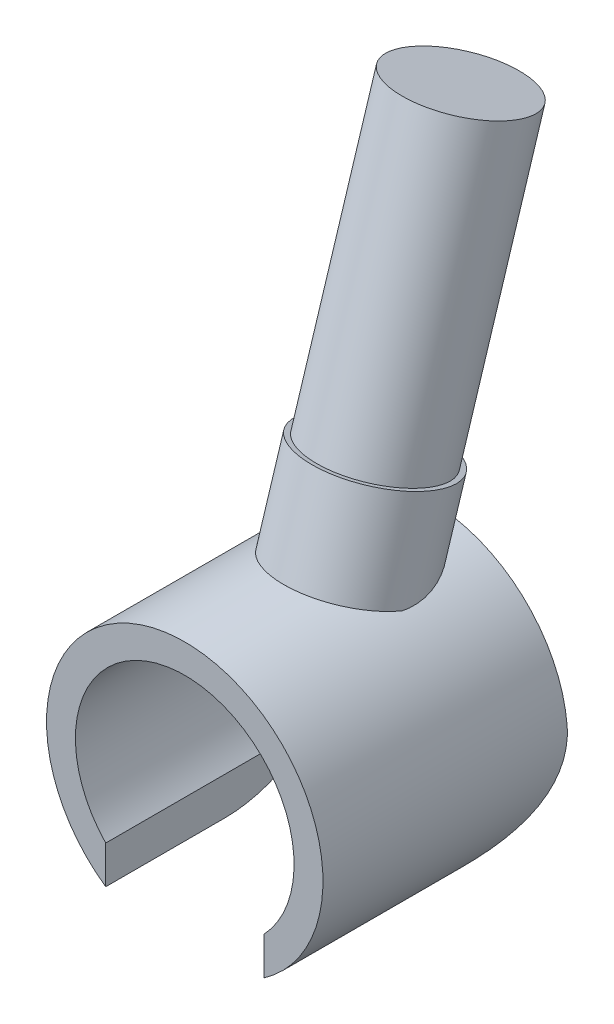
ISO-10303-21;
HEADER;
FILE_DESCRIPTION(('STEP AP214'),'2;1');
FILE_NAME('part.step','',(''),(''),'','','');
FILE_SCHEMA(('AUTOMOTIVE_DESIGN { 1 0 10303 214 1 1 1 1 }'));
ENDSEC;
DATA;
#1=APPLICATION_CONTEXT('core data for automotive mechanical design processes');
#2=APPLICATION_PROTOCOL_DEFINITION('international standard','automotive_design',2000,#1);
#3=PRODUCT_CONTEXT('',#1,'mechanical');
#4=PRODUCT('Part','Part','',(#3));
#5=PRODUCT_RELATED_PRODUCT_CATEGORY('part','',(#4));
#6=PRODUCT_DEFINITION_FORMATION('','',#4);
#7=PRODUCT_DEFINITION_CONTEXT('part definition',#1,'design');
#8=PRODUCT_DEFINITION('design','',#6,#7);
#9=PRODUCT_DEFINITION_SHAPE('','',#8);
#10=(LENGTH_UNIT() NAMED_UNIT(*) SI_UNIT(.MILLI.,.METRE.));
#11=(NAMED_UNIT(*) PLANE_ANGLE_UNIT() SI_UNIT($,.RADIAN.));
#12=(NAMED_UNIT(*) SI_UNIT($,.STERADIAN.) SOLID_ANGLE_UNIT());
#13=UNCERTAINTY_MEASURE_WITH_UNIT(LENGTH_MEASURE(1.E-05),#10,'distance_accuracy_value','');
#14=(GEOMETRIC_REPRESENTATION_CONTEXT(3) GLOBAL_UNCERTAINTY_ASSIGNED_CONTEXT((#13)) GLOBAL_UNIT_ASSIGNED_CONTEXT((#10,
#11,#12)) REPRESENTATION_CONTEXT('',''));
#15=CARTESIAN_POINT('',(0.,0.,0.));
#16=DIRECTION('',(0.,0.,1.));
#17=DIRECTION('',(1.,0.,0.));
#18=AXIS2_PLACEMENT_3D('',#15,#16,#17);
#19=CARTESIAN_POINT('',(0.,0.,2.16));
#20=DIRECTION('',(0.,0.,-1.));
#21=DIRECTION('',(-1.,0.,0.));
#22=AXIS2_PLACEMENT_3D('',#19,#20,#21);
#23=CYLINDRICAL_SURFACE('',#22,2.44);
#24=CARTESIAN_POINT('',(0.,2.44,0.411350822630164));
#25=CARTESIAN_POINT('',(-0.0653005720793101,2.43999803108042,0.411349449987554));
#26=CARTESIAN_POINT('',(-0.130622093755175,2.43735576615697,0.406430054839879));
#27=CARTESIAN_POINT('',(-0.259401431150825,2.42703336891758,0.386848874418601));
#28=CARTESIAN_POINT('',(-0.322858161902783,2.41935036215461,0.372181530384837));
#29=CARTESIAN_POINT('',(-0.446043886956785,2.39969411180188,0.333410248020092));
#30=CARTESIAN_POINT('',(-0.505776502788804,2.38772511502667,0.30931564859478));
#31=CARTESIAN_POINT('',(-0.619983711080264,2.36064975871494,0.252104831495627));
#32=CARTESIAN_POINT('',(-0.674457650161403,2.34554301005308,0.218987494716612));
#33=CARTESIAN_POINT('',(-0.777290595841828,2.31351563449002,0.143816894204556));
#34=CARTESIAN_POINT('',(-0.825571280068302,2.29657598763741,0.101664364527815));
#35=CARTESIAN_POINT('',(-0.913871784853915,2.26289084763905,0.00937185045244081));
#36=CARTESIAN_POINT('',(-0.953893590395186,2.24614530875572,-0.0407662095171709));
#37=CARTESIAN_POINT('',(-1.02352349214199,2.2152695253371,-0.146598044151709));
#38=CARTESIAN_POINT('',(-1.05337231559192,2.20108322693453,-0.202116379447018));
#39=CARTESIAN_POINT('',(-1.1031244932909,2.17657842065135,-0.318208649704171));
#40=CARTESIAN_POINT('',(-1.12303506746608,2.16625710630787,-0.378778877128956));
#41=CARTESIAN_POINT('',(-1.15153833613523,2.15123256306753,-0.498676812178326));
#42=CARTESIAN_POINT('',(-1.16081869501244,2.14619007986342,-0.557800610168284));
#43=CARTESIAN_POINT('',(-1.17068211053481,2.14082566462746,-0.676971017784378));
#44=CARTESIAN_POINT('',(-1.17126271580205,2.14050506310688,-0.737017882737286));
#45=CARTESIAN_POINT('',(-1.16423506373046,2.14433449272221,-0.85772369680256));
#46=CARTESIAN_POINT('',(-1.15645358761399,2.14857909264086,-0.918368786382599));
#47=CARTESIAN_POINT('',(-1.13319910098492,2.1609325459169,-1.03773711921797));
#48=CARTESIAN_POINT('',(-1.11772316374878,2.16904286962173,-1.09645962211783));
#49=CARTESIAN_POINT('',(-1.07671707659821,2.18972342536444,-1.22025764072028));
#50=CARTESIAN_POINT('',(-1.04997446814819,2.20279960693641,-1.28484641918799));
#51=CARTESIAN_POINT('',(-0.987764946383581,2.23138781288698,-1.40917626207865));
#52=CARTESIAN_POINT('',(-0.952285522456569,2.24690331861501,-1.46891021007678));
#53=CARTESIAN_POINT('',(-0.866969844278439,2.28131417880454,-1.59101613056404));
#54=CARTESIAN_POINT('',(-0.815769267648238,2.30036411849533,-1.65240110791273));
#55=CARTESIAN_POINT('',(-0.702746081641513,2.33736282386326,-1.76485214681573));
#56=CARTESIAN_POINT('',(-0.640942336523951,2.35531346963934,-1.81593618969345));
#57=CARTESIAN_POINT('',(-0.526915978088908,2.38292498380965,-1.89180434756867));
#58=CARTESIAN_POINT('',(-0.477123297779669,2.39347936650078,-1.91991790188145));
#59=CARTESIAN_POINT('',(-0.373291333948902,2.4118504840692,-1.96804917977064));
#60=CARTESIAN_POINT('',(-0.319256474665445,2.41967002591027,-1.98807520744345));
#61=CARTESIAN_POINT('',(-0.207765799580774,2.43178827022296,-2.01885737718193));
#62=CARTESIAN_POINT('',(-0.150288409987918,2.43606156837348,-2.02954666151028));
#63=CARTESIAN_POINT('',(-0.0341898752733999,2.44045027622977,-2.04052299584674));
#64=CARTESIAN_POINT('',(0.0244307285664932,2.44056760804509,-2.04081485460229));
#65=CARTESIAN_POINT('',(0.134173875363199,2.43685830965271,-2.03154018580275));
#66=CARTESIAN_POINT('',(0.185408298910467,2.43346668739952,-2.02306102807827));
#67=CARTESIAN_POINT('',(0.285698310027522,2.42374018115414,-1.99844586173391));
#68=CARTESIAN_POINT('',(0.334753436338657,2.41740467729643,-1.982308240528));
#69=CARTESIAN_POINT('',(0.431291719158435,2.40209506527847,-1.94259872325348));
#70=CARTESIAN_POINT('',(0.478663699301287,2.39303811003252,-1.91879140116926));
#71=CARTESIAN_POINT('',(0.569332063833355,2.37310339892996,-1.86502438549683));
#72=CARTESIAN_POINT('',(0.612626866068338,2.36222494074863,-1.83506231778234));
#73=CARTESIAN_POINT('',(0.702251454587681,2.33730215537085,-1.76406772199364));
#74=CARTESIAN_POINT('',(0.747709300454707,2.32304137214549,-1.72201297820579));
#75=CARTESIAN_POINT('',(0.83222390601898,2.2941234583253,-1.63200018463442));
#76=CARTESIAN_POINT('',(0.871274046668774,2.27946593588201,-1.58403611903223));
#77=CARTESIAN_POINT('',(0.950340221066301,2.24780561607845,-1.4725544863801));
#78=CARTESIAN_POINT('',(0.988814902197354,2.230962169129,-1.40789254085581));
#79=CARTESIAN_POINT('',(1.0555381706857,2.20017995575262,-1.27282862675951));
#80=CARTESIAN_POINT('',(1.08378626438138,2.18624132956206,-1.20242638129056));
#81=CARTESIAN_POINT('',(1.12658614300239,2.16446680277572,-1.06526659678993));
#82=CARTESIAN_POINT('',(1.14229924796789,2.15612966927259,-0.998954535665516));
#83=CARTESIAN_POINT('',(1.16382021162268,2.14459271562602,-0.8643021210946));
#84=CARTESIAN_POINT('',(1.16963753590325,2.14138798636622,-0.795963769600038));
#85=CARTESIAN_POINT('',(1.17033167439234,2.14101136213739,-0.65863777165604));
#86=CARTESIAN_POINT('',(1.16512613794288,2.14388487693287,-0.589649098491598));
#87=CARTESIAN_POINT('',(1.14292194545841,2.15580279166821,-0.454142243169775));
#88=CARTESIAN_POINT('',(1.12593000010488,2.16484368011857,-0.387622677900154));
#89=CARTESIAN_POINT('',(1.08319394272923,2.1864992180922,-0.267692927743385));
#90=CARTESIAN_POINT('',(1.05881111491558,2.19852509185328,-0.213683917418265));
#91=CARTESIAN_POINT('',(1.00175894778489,2.22509910319673,-0.110923290047883));
#92=CARTESIAN_POINT('',(0.969088396354225,2.23964760962591,-0.0621724435183424));
#93=CARTESIAN_POINT('',(0.896089244840698,2.2698437565163,0.0293858963028985));
#94=CARTESIAN_POINT('',(0.855709139709221,2.28549831575554,0.0721498574375224));
#95=CARTESIAN_POINT('',(0.768456773021097,2.31629319271887,0.150673756458614));
#96=CARTESIAN_POINT('',(0.721582317750198,2.33143333451789,0.1864313177715));
#97=CARTESIAN_POINT('',(0.619017251716324,2.36081612525713,0.252654974649521));
#98=CARTESIAN_POINT('',(0.562941366840129,2.37492460104106,0.282585156116928));
#99=CARTESIAN_POINT('',(0.446121166554609,2.3996112726627,0.333372957970391));
#100=CARTESIAN_POINT('',(0.385379026658519,2.41019110149251,0.354234776385552));
#101=CARTESIAN_POINT('',(0.27071757978636,2.42551296667486,0.383975491317249));
#102=CARTESIAN_POINT('',(0.217237535005981,2.4309134413503,0.394227288269128));
#103=CARTESIAN_POINT('',(0.109176511760547,2.43815770929765,0.407915390170712));
#104=CARTESIAN_POINT('',(0.0545955778280971,2.4400016461464,0.411351970249765));
#105=CARTESIAN_POINT('',(0.,2.44,0.411350822630164));
#106=B_SPLINE_CURVE_WITH_KNOTS('',3,(#24,#25,#26,#27,#28,#29,#30,#31,#32,#33,#34,#35,#36,#37,
#38,#39,#40,#41,#42,#43,#44,#45,#46,#47,#48,#49,#50,#51,#52,#53,#54,#55,#56,#57,#58,#59,#60,#61,
#62,#63,#64,#65,#66,#67,#68,#69,#70,#71,#72,#73,#74,#75,#76,#77,#78,#79,#80,#81,#82,#83,#84,#85,
#86,#87,#88,#89,#90,#91,#92,#93,#94,#95,#96,#97,#98,#99,#100,#101,#102,#103,#104,#105),
.UNSPECIFIED.,.T.,.F.,(4,2,2,2,2,2,2,2,2,2,2,2,2,2,2,2,2,2,2,2,2,2,2,2,2,2,2,2,2,2,2,2,2,2,2,2,
2,2,2,2,4),(0.,0.195703006941414,0.391517709233812,0.587138921091933,0.782784407230017,
0.980700949073429,1.17856986707394,1.37136470527047,1.56401927753215,1.74334639043292,
1.92272403238073,2.10589037075295,2.28912643302302,2.50167913395974,2.71453798617089,
2.95985926481142,3.20474853086091,3.37851962417741,3.55211183668365,3.72693713598632,
3.90168157857876,4.05708853713275,4.2125282331095,4.37328517042449,4.53410423482057,
4.72406831648601,4.91422740896027,5.14459094329916,5.37496559634942,5.5801057591812,
5.78504958913707,5.99152993300068,6.19789281210453,6.37843233112948,6.55899827003933,
6.7408156254192,6.9226945469586,7.11713309383293,7.31148153290818,7.47510873807879,
7.63872933750762),.UNSPECIFIED.);
#107=CARTESIAN_POINT('',(-1.15377398770942,2.14997804297744,-0.520375199168794));
#108=VERTEX_POINT('',#107);
#109=CARTESIAN_POINT('',(1.15377398770942,2.14997804297744,-0.520375199168794));
#110=VERTEX_POINT('',#109);
#111=EDGE_CURVE('E103',#108,#110,#106,.T.);
#112=ORIENTED_EDGE('',*,*,#111,.T.);
#113=CARTESIAN_POINT('',(0.,0.,-7.42740565128952));
#114=DIRECTION('',(0.,-0.954812686667349,0.297208232354151));
#115=DIRECTION('',(0.,-0.297208232354151,-0.954812686667349));
#116=AXIS2_PLACEMENT_3D('',#113,#114,#115);
#117=ELLIPSE('',#116,8.20973221593846,2.44);
#118=CARTESIAN_POINT('',(0.,2.44,0.411350822630163));
#119=VERTEX_POINT('',#118);
#120=EDGE_CURVE('E102',#110,#119,#117,.T.);
#121=ORIENTED_EDGE('',*,*,#120,.T.);
#122=EDGE_CURVE('E96',#119,#108,#117,.T.);
#123=ORIENTED_EDGE('',*,*,#122,.T.);
#124=EDGE_LOOP('',(#112,#121,#123));
#125=FACE_BOUND('',#124,.T.);
#126=CARTESIAN_POINT('',(0.,0.,-2.16));
#127=DIRECTION('',(0.,0.,1.));
#128=DIRECTION('',(1.,0.,0.));
#129=AXIS2_PLACEMENT_3D('',#126,#127,#128);
#130=CIRCLE('',#129,2.44);
#131=CARTESIAN_POINT('',(2.430232349588,0.218107145724329,-2.16));
#132=VERTEX_POINT('',#131);
#133=CARTESIAN_POINT('',(-2.43023234958799,0.218107145724329,-2.16));
#134=VERTEX_POINT('',#133);
#135=EDGE_CURVE('E163',#132,#134,#130,.T.);
#136=ORIENTED_EDGE('',*,*,#135,.T.);
#137=CARTESIAN_POINT('',(-2.43023234958799,0.218107145724329,-2.16));
#138=CARTESIAN_POINT('',(-2.43474060814688,0.168006973104005,-2.16001168935983));
#139=CARTESIAN_POINT('',(-2.4376758990569,0.117770171176608,-2.1583043473815));
#140=CARTESIAN_POINT('',(-2.44044982061713,0.0174684321543092,-2.15148274119778));
#141=CARTESIAN_POINT('',(-2.44029007287496,-0.0325965811948344,-2.14637026242797));
#142=CARTESIAN_POINT('',(-2.43694014535419,-0.131797724346114,-2.13281936887495));
#143=CARTESIAN_POINT('',(-2.43377220909971,-0.180937974329905,-2.12440563242008));
#144=CARTESIAN_POINT('',(-2.42457354957555,-0.278274928237631,-2.10436547455013));
#145=CARTESIAN_POINT('',(-2.41854261986041,-0.326471563858176,-2.09273882148248));
#146=CARTESIAN_POINT('',(-2.39642945385073,-0.468959479497071,-2.05329392326361));
#147=CARTESIAN_POINT('',(-2.37631639181392,-0.561413034429518,-2.02087377277521));
#148=CARTESIAN_POINT('',(-2.3271424912142,-0.739307803663008,-1.94528047287218));
#149=CARTESIAN_POINT('',(-2.2980651890097,-0.824735746039992,-1.90208756642188));
#150=CARTESIAN_POINT('',(-2.22208906031606,-1.01468152923659,-1.79053536120585));
#151=CARTESIAN_POINT('',(-2.1724829619143,-1.11601335843517,-1.71859205008861));
#152=CARTESIAN_POINT('',(-2.06564631642221,-1.30321386379243,-1.56141588668533));
#153=CARTESIAN_POINT('',(-2.00840177927345,-1.3890534700706,-1.47615859940118));
#154=CARTESIAN_POINT('',(-1.8899038674512,-1.54652412301911,-1.29254783208157));
#155=CARTESIAN_POINT('',(-1.82859610142771,-1.61786458404172,-1.19398219732798));
#156=CARTESIAN_POINT('',(-1.70851989675696,-1.74416017460002,-0.985361210738096));
#157=CARTESIAN_POINT('',(-1.64975004265832,-1.79912454107026,-0.875312383476714));
#158=CARTESIAN_POINT('',(-1.5612664010109,-1.87569756173117,-0.682420740142048));
#159=CARTESIAN_POINT('',(-1.52845436939761,-1.90229801224119,-0.602992652485694));
#160=CARTESIAN_POINT('',(-1.47144099361139,-1.94673145245156,-0.43902559324608));
#161=CARTESIAN_POINT('',(-1.44719584391018,-1.96460922864679,-0.354515286553389));
#162=CARTESIAN_POINT('',(-1.41829905016411,-1.98550395450505,-0.214591813272451));
#163=CARTESIAN_POINT('',(-1.40969894116898,-1.9915908726845,-0.160454200423307));
#164=CARTESIAN_POINT('',(-1.39798705475527,-1.99981224665755,-0.050913632403747));
#165=CARTESIAN_POINT('',(-1.39491468901932,-2.0019183252101,0.00449557859322755));
#166=CARTESIAN_POINT('',(-1.395,-2.00189285427567,0.0600000000000026));
#167=B_SPLINE_CURVE_WITH_KNOTS('',3,(#137,#138,#139,#140,#141,#142,#143,#144,#145,#146,#147,
#148,#149,#150,#151,#152,#153,#154,#155,#156,#157,#158,#159,#160,#161,#162,#163,#164,#165,#166),
.UNSPECIFIED.,.F.,.F.,(4,2,2,2,2,2,2,2,2,2,2,2,2,2,4),(0.,0.150846331968014,0.301613631984807,
0.451274720267462,0.600946601990361,0.899499998603086,1.19860501553044,1.59786296890622,
1.99786247960152,2.40522396872608,2.8123552487426,3.0815494028285,3.34934644287952,
3.51440445371051,3.68063469994443),.UNSPECIFIED.);
#168=CARTESIAN_POINT('',(-1.395,-2.00189285427567,0.0600000000000019));
#169=VERTEX_POINT('',#168);
#170=EDGE_CURVE('E157',#134,#169,#167,.T.);
#171=ORIENTED_EDGE('',*,*,#170,.T.);
#172=DIRECTION('',(0.,0.,-1.));
#173=VECTOR('',#172,1.);
#174=CARTESIAN_POINT('',(-1.395,-2.00189285427567,2.16));
#175=LINE('',#174,#173);
#176=CARTESIAN_POINT('',(-1.395,-2.00189285427567,2.16));
#177=VERTEX_POINT('',#176);
#178=EDGE_CURVE('E186',#177,#169,#175,.T.);
#179=ORIENTED_EDGE('',*,*,#178,.F.);
#180=CARTESIAN_POINT('',(0.,0.,2.16));
#181=DIRECTION('',(0.,0.,1.));
#182=DIRECTION('',(1.,0.,0.));
#183=AXIS2_PLACEMENT_3D('',#180,#181,#182);
#184=CIRCLE('',#183,2.44);
#185=CARTESIAN_POINT('',(1.395,-2.00189285427567,2.16));
#186=VERTEX_POINT('',#185);
#187=EDGE_CURVE('E164',#186,#177,#184,.T.);
#188=ORIENTED_EDGE('',*,*,#187,.F.);
#189=DIRECTION('',(0.,0.,-1.));
#190=VECTOR('',#189,1.);
#191=CARTESIAN_POINT('',(1.395,-2.00189285427567,2.16));
#192=LINE('',#191,#190);
#193=CARTESIAN_POINT('',(1.395,-2.00189285427567,0.0600000000000019));
#194=VERTEX_POINT('',#193);
#195=EDGE_CURVE('E174',#186,#194,#192,.T.);
#196=ORIENTED_EDGE('',*,*,#195,.T.);
#197=CARTESIAN_POINT('',(1.395,-2.00189285427567,0.0600000000000023));
#198=CARTESIAN_POINT('',(1.39497549417186,-2.00190004682214,0.0190355748298361));
#199=CARTESIAN_POINT('',(1.3966286569488,-2.00075856017163,-0.0219004856777222));
#200=CARTESIAN_POINT('',(1.40307178395955,-1.9962499970007,-0.103324324666599));
#201=CARTESIAN_POINT('',(1.40785566693987,-1.99288723506834,-0.143812817793326));
#202=CARTESIAN_POINT('',(1.4264029958197,-1.9796983463629,-0.263076645845645));
#203=CARTESIAN_POINT('',(1.44437530386783,-1.9667668108115,-0.340873583725885));
#204=CARTESIAN_POINT('',(1.49736001707902,-1.92690662521998,-0.522307061088923));
#205=CARTESIAN_POINT('',(1.53630355064597,-1.89646085075228,-0.623955837566314));
#206=CARTESIAN_POINT('',(1.6228510700733,-1.82296684301684,-0.819450953192354));
#207=CARTESIAN_POINT('',(1.67052415633827,-1.77981625547563,-0.913225646178747));
#208=CARTESIAN_POINT('',(1.75315039184214,-1.69773154487245,-1.0637167755138));
#209=CARTESIAN_POINT('',(1.78725378542758,-1.66191720502314,-1.12263961007733));
#210=CARTESIAN_POINT('',(1.85575130772401,-1.58506815034893,-1.23680394987571));
#211=CARTESIAN_POINT('',(1.89014553524551,-1.54403158880396,-1.29204414224594));
#212=CARTESIAN_POINT('',(1.99203481038013,-1.41334265560727,-1.45184299170412));
#213=CARTESIAN_POINT('',(2.05849664197669,-1.31586757883351,-1.55092604023674));
#214=CARTESIAN_POINT('',(2.16658026914772,-1.12625881572758,-1.70988630064897));
#215=CARTESIAN_POINT('',(2.21034051749566,-1.03842799456176,-1.77347168819425));
#216=CARTESIAN_POINT('',(2.2888664736532,-0.851422943099089,-1.88846176692822));
#217=CARTESIAN_POINT('',(2.32364287417548,-0.752262402343806,-1.93988093235025));
#218=CARTESIAN_POINT('',(2.37640148573411,-0.560852946506084,-2.02102148300261));
#219=CARTESIAN_POINT('',(2.3961748234636,-0.47001210116017,-2.05289291788829));
#220=CARTESIAN_POINT('',(2.42531006662676,-0.283435705925214,-2.10475880127211));
#221=CARTESIAN_POINT('',(2.4346893623598,-0.187708612862024,-2.12477306184283));
#222=CARTESIAN_POINT('',(2.44021747583738,-0.0397433074760839,-2.14558422779519));
#223=CARTESIAN_POINT('',(2.44051604297717,0.0117535756679163,-2.15099243216923));
#224=CARTESIAN_POINT('',(2.43783986354329,0.114909952459421,-2.15820369403941));
#225=CARTESIAN_POINT('',(2.43486537271731,0.166569433087527,-2.16000703317872));
#226=CARTESIAN_POINT('',(2.43023234958799,0.218107145724329,-2.16));
#227=B_SPLINE_CURVE_WITH_KNOTS('',3,(#197,#198,#199,#200,#201,#202,#203,#204,#205,#206,#207,
#208,#209,#210,#211,#212,#213,#214,#215,#216,#217,#218,#219,#220,#221,#222,#223,#224,#225,#226),
.UNSPECIFIED.,.F.,.F.,(4,2,2,2,2,2,2,2,2,2,2,2,2,2,4),(0.,0.122794676737796,0.245351536657706,
0.486852474351929,0.824125595645047,1.16419393742833,1.39471038167206,1.6253085705271,
2.08481172056646,2.43436467314526,2.78349964542083,3.07712016359925,3.37024867932407,
3.52538654727439,3.68051229404198),.UNSPECIFIED.);
#228=EDGE_CURVE('E125',#194,#132,#227,.T.);
#229=ORIENTED_EDGE('',*,*,#228,.T.);
#230=EDGE_LOOP('',(#136,#171,#179,#188,#196,#229));
#231=FACE_BOUND('',#230,.T.);
#232=ADVANCED_FACE('F34',(#125,#231),#23,.T.);
#233=CARTESIAN_POINT('',(-1.395,-1.33374472819952,2.16));
#234=DIRECTION('',(-1.,0.,0.));
#235=DIRECTION('',(0.,0.,1.));
#236=AXIS2_PLACEMENT_3D('',#233,#234,#235);
#237=PLANE('',#236);
#238=ORIENTED_EDGE('',*,*,#178,.T.);
#239=CARTESIAN_POINT('',(-1.395,0.218107145724329,0.0600000000000019));
#240=DIRECTION('',(-1.,0.,0.));
#241=DIRECTION('',(0.,0.,1.));
#242=AXIS2_PLACEMENT_3D('',#239,#240,#241);
#243=CIRCLE('',#242,2.22);
#244=CARTESIAN_POINT('',(-1.395,-1.33374472819952,-1.52749984610993));
#245=VERTEX_POINT('',#244);
#246=EDGE_CURVE('E155',#169,#245,#243,.F.);
#247=ORIENTED_EDGE('',*,*,#246,.T.);
#248=DIRECTION('',(0.,0.,-1.));
#249=VECTOR('',#248,1.);
#250=CARTESIAN_POINT('',(-1.395,-1.33374472819952,2.16));
#251=LINE('',#250,#249);
#252=CARTESIAN_POINT('',(-1.395,-1.33374472819952,2.16));
#253=VERTEX_POINT('',#252);
#254=EDGE_CURVE('E184',#253,#245,#251,.T.);
#255=ORIENTED_EDGE('',*,*,#254,.F.);
#256=DIRECTION('',(0.,1.,0.));
#257=VECTOR('',#256,1.);
#258=CARTESIAN_POINT('',(-1.395,-1.33374472819952,2.16));
#259=LINE('',#258,#257);
#260=EDGE_CURVE('E167',#177,#253,#259,.T.);
#261=ORIENTED_EDGE('',*,*,#260,.F.);
#262=EDGE_LOOP('',(#238,#247,#255,#261));
#263=FACE_BOUND('',#262,.T.);
#264=ADVANCED_FACE('F204',(#263),#237,.F.);
#265=CARTESIAN_POINT('',(0.,0.,2.16));
#266=DIRECTION('',(0.,0.,-1.));
#267=DIRECTION('',(-1.,0.,0.));
#268=AXIS2_PLACEMENT_3D('',#265,#266,#267);
#269=CYLINDRICAL_SURFACE('',#268,1.93);
#270=ORIENTED_EDGE('',*,*,#254,.T.);
#271=CARTESIAN_POINT('',(-1.395,-1.33374472819952,-1.52749984610993));
#272=CARTESIAN_POINT('',(-1.4613650591104,-1.26433642421857,-1.59541284265482));
#273=CARTESIAN_POINT('',(-1.52420782443013,-1.18821024003292,-1.66084559551919));
#274=CARTESIAN_POINT('',(-1.640340561821,-1.02204651703401,-1.78423382737669));
#275=CARTESIAN_POINT('',(-1.69352250187591,-0.931870397557288,-1.8421029302637));
#276=CARTESIAN_POINT('',(-1.77666601437337,-0.758659479664663,-1.93547007046637));
#277=CARTESIAN_POINT('',(-1.80915593467325,-0.678023834503858,-1.97311856776486));
#278=CARTESIAN_POINT('',(-1.86342994800844,-0.510131718898834,-2.03907496546273));
#279=CARTESIAN_POINT('',(-1.88528199643524,-0.422921497000988,-2.06744176548355));
#280=CARTESIAN_POINT('',(-1.90875490372367,-0.289105462252128,-2.10176639959498));
#281=CARTESIAN_POINT('',(-1.91501728095762,-0.244296715664214,-2.11179840442425));
#282=CARTESIAN_POINT('',(-1.92439766783169,-0.153814891424227,-2.12910749867783));
#283=CARTESIAN_POINT('',(-1.92751593387305,-0.108141884561813,-2.13638481271605));
#284=CARTESIAN_POINT('',(-1.93049634126748,-0.0157192653420156,-2.14814873751903));
#285=CARTESIAN_POINT('',(-1.93031497838352,0.0310366009128516,-2.15259726081316));
#286=CARTESIAN_POINT('',(-1.92654495623045,0.124627980549224,-2.15853034740784));
#287=CARTESIAN_POINT('',(-1.92295414871276,0.171463525561495,-2.16001304014549));
#288=CARTESIAN_POINT('',(-1.91763637663244,0.218107145724329,-2.16));
#289=B_SPLINE_CURVE_WITH_KNOTS('',3,(#271,#272,#273,#274,#275,#276,#277,#278,#279,#280,#281,
#282,#283,#284,#285,#286,#287,#288),.UNSPECIFIED.,.F.,.F.,(4,2,2,2,2,2,2,2,4),(0.,
0.353464690607776,0.710666733775624,0.99376903384324,1.27503832028141,1.41390310542213,
1.55275656526901,1.69344206161801,1.83421626101107),.UNSPECIFIED.);
#290=CARTESIAN_POINT('',(-1.91763637663244,0.218107145724329,-2.16));
#291=VERTEX_POINT('',#290);
#292=EDGE_CURVE('E149',#245,#291,#289,.T.);
#293=ORIENTED_EDGE('',*,*,#292,.T.);
#294=CARTESIAN_POINT('',(0.,0.,-2.16));
#295=DIRECTION('',(0.,0.,-1.));
#296=DIRECTION('',(1.,0.,0.));
#297=AXIS2_PLACEMENT_3D('',#294,#295,#296);
#298=CIRCLE('',#297,1.93);
#299=CARTESIAN_POINT('',(1.91763637663244,0.218107145724329,-2.16));
#300=VERTEX_POINT('',#299);
#301=EDGE_CURVE('E168',#291,#300,#298,.T.);
#302=ORIENTED_EDGE('',*,*,#301,.T.);
#303=CARTESIAN_POINT('',(1.91763637663244,0.218107145724329,-2.16));
#304=CARTESIAN_POINT('',(1.9226721247151,0.173921329664467,-2.16001047697693));
#305=CARTESIAN_POINT('',(1.92616046455742,0.129562919534623,-2.15868109277474));
#306=CARTESIAN_POINT('',(1.93007409882216,0.0408923616220409,-2.15335818514194));
#307=CARTESIAN_POINT('',(1.93050090339903,-0.0034197981875244,-2.14936597625733));
#308=CARTESIAN_POINT('',(1.92834107636796,-0.0911254582141884,-2.13879628584775));
#309=CARTESIAN_POINT('',(1.92579026432846,-0.134523614522695,-2.13225015235817));
#310=CARTESIAN_POINT('',(1.91783974465311,-0.22059376673638,-2.11666209031369));
#311=CARTESIAN_POINT('',(1.91243988541359,-0.263265723874259,-2.10762002895754));
#312=CARTESIAN_POINT('',(1.8921805373519,-0.38961352641322,-2.07694932926334));
#313=CARTESIAN_POINT('',(1.87325516244209,-0.471826598508137,-2.05175080265074));
#314=CARTESIAN_POINT('',(1.82590936910418,-0.630798639480564,-1.99305094721525));
#315=CARTESIAN_POINT('',(1.79743036630446,-0.707520323030753,-1.95949872777724));
#316=CARTESIAN_POINT('',(1.71714167972385,-0.888982483069175,-1.86805271977348));
#317=CARTESIAN_POINT('',(1.66067782844072,-0.989693579097232,-1.8061716107234));
#318=CARTESIAN_POINT('',(1.5669529542964,-1.12811859799147,-1.7061563243066));
#319=CARTESIAN_POINT('',(1.53435151719598,-1.17200588105377,-1.67176745554311));
#320=CARTESIAN_POINT('',(1.4665472542806,-1.25579285012763,-1.60102335932303));
#321=CARTESIAN_POINT('',(1.43135066747926,-1.29570159006335,-1.56467290078456));
#322=CARTESIAN_POINT('',(1.395,-1.33374472819952,-1.52749984610993));
#323=B_SPLINE_CURVE_WITH_KNOTS('',3,(#303,#304,#305,#306,#307,#308,#309,#310,#311,#312,#313,
#314,#315,#316,#317,#318,#319,#320,#321,#322),.UNSPECIFIED.,.F.,.F.,(4,2,2,2,2,2,2,2,2,4),(0.,
0.133362580494559,0.266659373096977,0.398369040969633,0.530085718092299,0.792906478518415,
1.05736929023088,1.4476166711137,1.6412301938488,1.83439254166487),.UNSPECIFIED.);
#324=CARTESIAN_POINT('',(1.395,-1.33374472819952,-1.52749984610993));
#325=VERTEX_POINT('',#324);
#326=EDGE_CURVE('E57',#300,#325,#323,.T.);
#327=ORIENTED_EDGE('',*,*,#326,.T.);
#328=DIRECTION('',(0.,0.,-1.));
#329=VECTOR('',#328,1.);
#330=CARTESIAN_POINT('',(1.395,-1.33374472819952,2.16));
#331=LINE('',#330,#329);
#332=CARTESIAN_POINT('',(1.395,-1.33374472819952,2.16));
#333=VERTEX_POINT('',#332);
#334=EDGE_CURVE('E181',#333,#325,#331,.T.);
#335=ORIENTED_EDGE('',*,*,#334,.F.);
#336=CARTESIAN_POINT('',(0.,0.,2.16));
#337=DIRECTION('',(0.,0.,-1.));
#338=DIRECTION('',(1.,0.,0.));
#339=AXIS2_PLACEMENT_3D('',#336,#337,#338);
#340=CIRCLE('',#339,1.93);
#341=EDGE_CURVE('E170',#253,#333,#340,.T.);
#342=ORIENTED_EDGE('',*,*,#341,.F.);
#343=EDGE_LOOP('',(#270,#293,#302,#327,#335,#342));
#344=FACE_BOUND('',#343,.T.);
#345=ADVANCED_FACE('F130',(#344),#269,.F.);
#346=CARTESIAN_POINT('',(1.395,-1.33374472819952,2.16));
#347=DIRECTION('',(1.,0.,0.));
#348=DIRECTION('',(0.,0.,-1.));
#349=AXIS2_PLACEMENT_3D('',#346,#347,#348);
#350=PLANE('',#349);
#351=ORIENTED_EDGE('',*,*,#334,.T.);
#352=CARTESIAN_POINT('',(1.395,0.218107145724329,0.0600000000000019));
#353=DIRECTION('',(1.,0.,0.));
#354=DIRECTION('',(0.,0.,-1.));
#355=AXIS2_PLACEMENT_3D('',#352,#353,#354);
#356=CIRCLE('',#355,2.22);
#357=EDGE_CURVE('E111',#325,#194,#356,.F.);
#358=ORIENTED_EDGE('',*,*,#357,.T.);
#359=ORIENTED_EDGE('',*,*,#195,.F.);
#360=DIRECTION('',(0.,-1.,0.));
#361=VECTOR('',#360,1.);
#362=CARTESIAN_POINT('',(1.395,-1.33374472819952,2.16));
#363=LINE('',#362,#361);
#364=EDGE_CURVE('E172',#333,#186,#363,.T.);
#365=ORIENTED_EDGE('',*,*,#364,.F.);
#366=EDGE_LOOP('',(#351,#358,#359,#365));
#367=FACE_BOUND('',#366,.T.);
#368=ADVANCED_FACE('F198',(#367),#350,.F.);
#369=CARTESIAN_POINT('',(0.,0.,2.16));
#370=DIRECTION('',(0.,0.,1.));
#371=DIRECTION('',(1.,0.,0.));
#372=AXIS2_PLACEMENT_3D('',#369,#370,#371);
#373=PLANE('',#372);
#374=ORIENTED_EDGE('',*,*,#187,.T.);
#375=ORIENTED_EDGE('',*,*,#260,.T.);
#376=ORIENTED_EDGE('',*,*,#341,.T.);
#377=ORIENTED_EDGE('',*,*,#364,.T.);
#378=EDGE_LOOP('',(#374,#375,#376,#377));
#379=FACE_BOUND('',#378,.T.);
#380=ADVANCED_FACE('F143',(#379),#373,.T.);
#381=CARTESIAN_POINT('',(0.,0.,-2.16));
#382=DIRECTION('',(0.,0.,1.));
#383=DIRECTION('',(1.,0.,0.));
#384=AXIS2_PLACEMENT_3D('',#381,#382,#383);
#385=PLANE('',#384);
#386=ORIENTED_EDGE('',*,*,#135,.F.);
#387=DIRECTION('',(1.,0.,0.));
#388=VECTOR('',#387,1.);
#389=CARTESIAN_POINT('',(-2.5,0.218107145724329,-2.16));
#390=LINE('',#389,#388);
#391=EDGE_CURVE('E11',#132,#300,#390,.F.);
#392=ORIENTED_EDGE('',*,*,#391,.T.);
#393=ORIENTED_EDGE('',*,*,#301,.F.);
#394=EDGE_CURVE('E38',#291,#134,#390,.F.);
#395=ORIENTED_EDGE('',*,*,#394,.T.);
#396=EDGE_LOOP('',(#386,#392,#393,#395));
#397=FACE_BOUND('',#396,.T.);
#398=ADVANCED_FACE('F139',(#397),#385,.F.);
#399=CARTESIAN_POINT('',(-2.5,0.218107145724329,0.0600000000000019));
#400=DIRECTION('',(1.,0.,0.));
#401=DIRECTION('',(0.,0.,-1.));
#402=AXIS2_PLACEMENT_3D('',#399,#400,#401);
#403=CYLINDRICAL_SURFACE('',#402,2.22);
#404=ORIENTED_EDGE('',*,*,#394,.F.);
#405=ORIENTED_EDGE('',*,*,#292,.F.);
#406=ORIENTED_EDGE('',*,*,#246,.F.);
#407=ORIENTED_EDGE('',*,*,#170,.F.);
#408=EDGE_LOOP('',(#404,#405,#406,#407));
#409=FACE_BOUND('',#408,.T.);
#410=ADVANCED_FACE('F133',(#409),#403,.T.);
#411=ORIENTED_EDGE('',*,*,#357,.F.);
#412=ORIENTED_EDGE('',*,*,#326,.F.);
#413=ORIENTED_EDGE('',*,*,#391,.F.);
#414=ORIENTED_EDGE('',*,*,#228,.F.);
#415=EDGE_LOOP('',(#411,#412,#413,#414));
#416=FACE_BOUND('',#415,.T.);
#417=ADVANCED_FACE('F138',(#416),#403,.T.);
#418=CARTESIAN_POINT('',(0.,2.44,0.411350822630164));
#419=DIRECTION('',(0.,-0.954812686667349,0.297208232354151));
#420=DIRECTION('',(0.,-0.297208232354151,-0.954812686667349));
#421=AXIS2_PLACEMENT_3D('',#418,#419,#420);
#422=PLANE('',#421);
#423=ORIENTED_EDGE('',*,*,#120,.F.);
#424=CARTESIAN_POINT('',(0.,2.09226636814564,-0.705780020770635));
#425=DIRECTION('',(0.,0.954812686667349,-0.297208232354151));
#426=DIRECTION('',(0.,0.297208232354151,0.954812686667349));
#427=AXIS2_PLACEMENT_3D('',#424,#425,#426);
#428=CIRCLE('',#427,1.17);
#429=EDGE_CURVE('E49',#119,#110,#428,.T.);
#430=ORIENTED_EDGE('',*,*,#429,.F.);
#431=EDGE_LOOP('',(#423,#430));
#432=FACE_BOUND('',#431,.T.);
#433=ADVANCED_FACE('F109',(#432),#422,.T.);
#434=ORIENTED_EDGE('',*,*,#122,.F.);
#435=EDGE_CURVE('E98',#108,#119,#428,.T.);
#436=ORIENTED_EDGE('',*,*,#435,.F.);
#437=EDGE_LOOP('',(#434,#436));
#438=FACE_BOUND('',#437,.T.);
#439=ADVANCED_FACE('F97',(#438),#422,.T.);
#440=CARTESIAN_POINT('',(0.,8.54,-2.71279096875302));
#441=DIRECTION('',(0.,0.954812686667349,-0.297208232354151));
#442=DIRECTION('',(0.,0.297208232354151,0.954812686667349));
#443=AXIS2_PLACEMENT_3D('',#440,#441,#442);
#444=CYLINDRICAL_SURFACE('',#443,1.17);
#445=CARTESIAN_POINT('',(0.,3.68,-1.2));
#446=DIRECTION('',(0.,0.954812686667349,-0.297208232354151));
#447=DIRECTION('',(0.,0.297208232354151,0.954812686667349));
#448=AXIS2_PLACEMENT_3D('',#445,#446,#447);
#449=CIRCLE('',#448,1.17);
#450=CARTESIAN_POINT('',(0.,4.02773363185436,-0.0828691565992012));
#451=VERTEX_POINT('',#450);
#452=EDGE_CURVE('E106',#451,#451,#449,.T.);
#453=ORIENTED_EDGE('',*,*,#452,.F.);
#454=EDGE_LOOP('',(#453));
#455=FACE_BOUND('',#454,.T.);
#456=ORIENTED_EDGE('',*,*,#111,.F.);
#457=ORIENTED_EDGE('',*,*,#435,.T.);
#458=ORIENTED_EDGE('',*,*,#429,.T.);
#459=EDGE_LOOP('',(#456,#457,#458));
#460=FACE_BOUND('',#459,.T.);
#461=ADVANCED_FACE('F105',(#455,#460),#444,.T.);
#462=CARTESIAN_POINT('',(0.,8.86098489094248,-1.68159326715229));
#463=DIRECTION('',(0.,0.954812686667349,-0.297208232354151));
#464=DIRECTION('',(0.,0.297208232354151,0.954812686667349));
#465=AXIS2_PLACEMENT_3D('',#462,#463,#464);
#466=PLANE('',#465);
#467=CARTESIAN_POINT('',(0.,8.54,-2.71279096875302));
#468=DIRECTION('',(0.,0.954812686667349,-0.297208232354151));
#469=DIRECTION('',(0.,0.297208232354151,0.954812686667349));
#470=AXIS2_PLACEMENT_3D('',#467,#468,#469);
#471=CIRCLE('',#470,1.08);
#472=CARTESIAN_POINT('',(0.,8.86098489094248,-1.68159326715229));
#473=VERTEX_POINT('',#472);
#474=EDGE_CURVE('E318',#473,#473,#471,.T.);
#475=ORIENTED_EDGE('',*,*,#474,.T.);
#476=EDGE_LOOP('',(#475));
#477=FACE_BOUND('',#476,.T.);
#478=ADVANCED_FACE('F141',(#477),#466,.T.);
#479=CARTESIAN_POINT('',(0.,4.02773363185436,-0.0828691565992009));
#480=DIRECTION('',(0.,0.954812686667349,-0.297208232354151));
#481=DIRECTION('',(0.,0.297208232354151,0.954812686667349));
#482=AXIS2_PLACEMENT_3D('',#479,#480,#481);
#483=PLANE('',#482);
#484=ORIENTED_EDGE('',*,*,#452,.T.);
#485=EDGE_LOOP('',(#484));
#486=FACE_BOUND('',#485,.T.);
#487=CARTESIAN_POINT('',(0.,3.68,-1.2));
#488=DIRECTION('',(0.,0.954812686667349,-0.297208232354151));
#489=DIRECTION('',(0.,0.297208232354151,0.954812686667349));
#490=AXIS2_PLACEMENT_3D('',#487,#488,#489);
#491=CIRCLE('',#490,1.08);
#492=CARTESIAN_POINT('',(0.,4.00098489094248,-0.168802298399262));
#493=VERTEX_POINT('',#492);
#494=EDGE_CURVE('E315',#493,#493,#491,.T.);
#495=ORIENTED_EDGE('',*,*,#494,.F.);
#496=EDGE_LOOP('',(#495));
#497=FACE_BOUND('',#496,.T.);
#498=ADVANCED_FACE('F283',(#486,#497),#483,.T.);
#499=CARTESIAN_POINT('',(0.,8.54,-2.71279096875302));
#500=DIRECTION('',(0.,0.954812686667349,-0.297208232354151));
#501=DIRECTION('',(0.,0.297208232354151,0.954812686667349));
#502=AXIS2_PLACEMENT_3D('',#499,#500,#501);
#503=CYLINDRICAL_SURFACE('',#502,1.08);
#504=ORIENTED_EDGE('',*,*,#494,.T.);
#505=EDGE_LOOP('',(#504));
#506=FACE_BOUND('',#505,.T.);
#507=ORIENTED_EDGE('',*,*,#474,.F.);
#508=EDGE_LOOP('',(#507));
#509=FACE_BOUND('',#508,.T.);
#510=ADVANCED_FACE('F291',(#506,#509),#503,.T.);
#511=CLOSED_SHELL('',(#232,#264,#345,#368,#380,#398,#410,#417,#433,#439,#461,#478,#498,#510));
#512=MANIFOLD_SOLID_BREP('B2',#511);
#513=ADVANCED_BREP_SHAPE_REPRESENTATION('',(#18,#512),#14);
#514=SHAPE_DEFINITION_REPRESENTATION(#9,#513);
ENDSEC;
END-ISO-10303-21;
